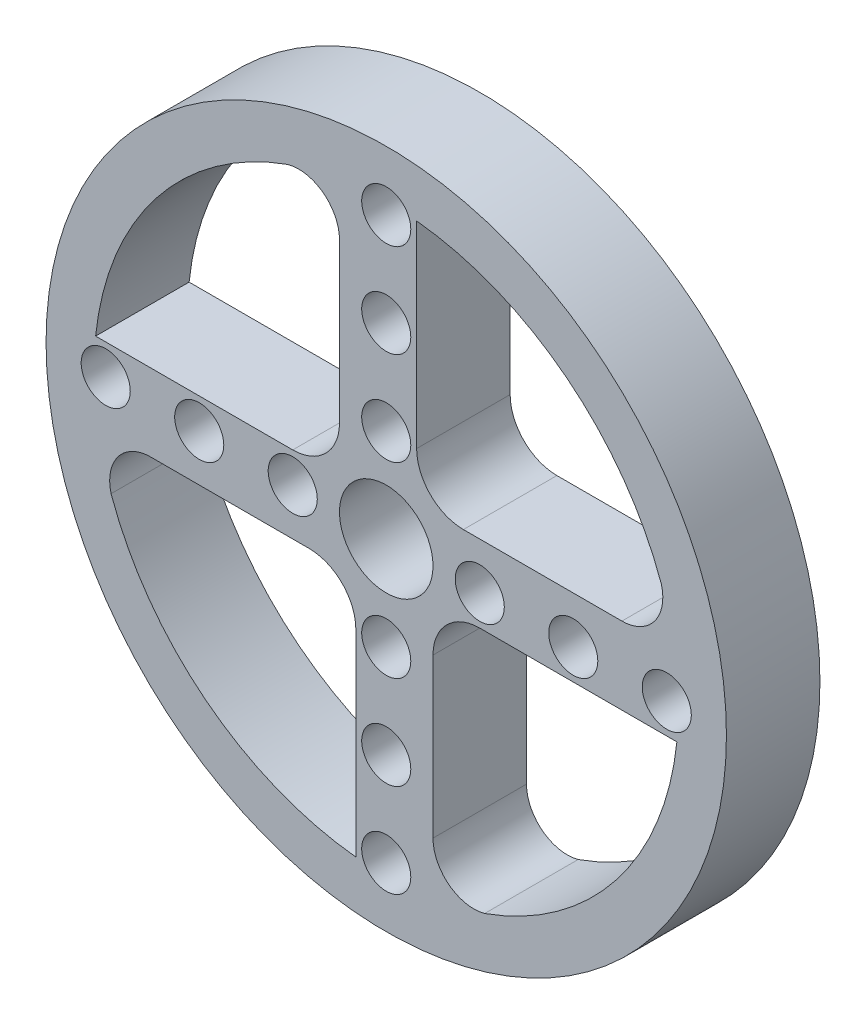
ISO-10303-21;
HEADER;
FILE_DESCRIPTION(('STEP AP214'),'2;1');
FILE_NAME('part.step','',(''),(''),'','','');
FILE_SCHEMA(('AUTOMOTIVE_DESIGN { 1 0 10303 214 1 1 1 1 }'));
ENDSEC;
DATA;
#1=APPLICATION_CONTEXT('core data for automotive mechanical design processes');
#2=APPLICATION_PROTOCOL_DEFINITION('international standard','automotive_design',2000,#1);
#3=PRODUCT_CONTEXT('',#1,'mechanical');
#4=PRODUCT('Part','Part','',(#3));
#5=PRODUCT_RELATED_PRODUCT_CATEGORY('part','',(#4));
#6=PRODUCT_DEFINITION_FORMATION('','',#4);
#7=PRODUCT_DEFINITION_CONTEXT('part definition',#1,'design');
#8=PRODUCT_DEFINITION('design','',#6,#7);
#9=PRODUCT_DEFINITION_SHAPE('','',#8);
#10=(LENGTH_UNIT() NAMED_UNIT(*) SI_UNIT(.MILLI.,.METRE.));
#11=(NAMED_UNIT(*) PLANE_ANGLE_UNIT() SI_UNIT($,.RADIAN.));
#12=(NAMED_UNIT(*) SI_UNIT($,.STERADIAN.) SOLID_ANGLE_UNIT());
#13=UNCERTAINTY_MEASURE_WITH_UNIT(LENGTH_MEASURE(1.E-05),#10,'distance_accuracy_value','');
#14=(GEOMETRIC_REPRESENTATION_CONTEXT(3) GLOBAL_UNCERTAINTY_ASSIGNED_CONTEXT((#13)) GLOBAL_UNIT_ASSIGNED_CONTEXT((#10,
#11,#12)) REPRESENTATION_CONTEXT('',''));
#15=CARTESIAN_POINT('',(0.,0.,0.));
#16=DIRECTION('',(0.,0.,1.));
#17=DIRECTION('',(1.,0.,0.));
#18=AXIS2_PLACEMENT_3D('',#15,#16,#17);
#19=CARTESIAN_POINT('',(0.,4.,8.));
#20=DIRECTION('',(0.,1.,0.));
#21=DIRECTION('',(-1.,0.,0.));
#22=AXIS2_PLACEMENT_3D('',#19,#20,#21);
#23=PLANE('',#22);
#24=DIRECTION('',(1.,0.,0.));
#25=VECTOR('',#24,1.);
#26=CARTESIAN_POINT('',(0.,4.,0.));
#27=LINE('',#26,#25);
#28=CARTESIAN_POINT('',(6.59999999999997,3.99999999999996,0.));
#29=VERTEX_POINT('',#28);
#30=CARTESIAN_POINT('',(20.1628902848437,3.99999999999986,0.));
#31=VERTEX_POINT('',#30);
#32=EDGE_CURVE('E332',#29,#31,#27,.T.);
#33=ORIENTED_EDGE('',*,*,#32,.F.);
#34=DIRECTION('',(0.,0.,-1.));
#35=VECTOR('',#34,1.);
#36=CARTESIAN_POINT('',(6.59999999999997,3.99999999999996,8.));
#37=LINE('',#36,#35);
#38=CARTESIAN_POINT('',(6.59999999999997,3.99999999999996,8.));
#39=VERTEX_POINT('',#38);
#40=EDGE_CURVE('E11',#39,#29,#37,.T.);
#41=ORIENTED_EDGE('',*,*,#40,.F.);
#42=DIRECTION('',(1.,0.,0.));
#43=VECTOR('',#42,1.);
#44=CARTESIAN_POINT('',(0.,4.,8.));
#45=LINE('',#44,#43);
#46=CARTESIAN_POINT('',(20.1628902848437,3.99999999999986,8.));
#47=VERTEX_POINT('',#46);
#48=EDGE_CURVE('E245',#39,#47,#45,.T.);
#49=ORIENTED_EDGE('',*,*,#48,.T.);
#50=DIRECTION('',(0.,0.,-1.));
#51=VECTOR('',#50,1.);
#52=CARTESIAN_POINT('',(20.1628902848437,3.99999999999986,8.));
#53=LINE('',#52,#51);
#54=EDGE_CURVE('E51',#47,#31,#53,.T.);
#55=ORIENTED_EDGE('',*,*,#54,.T.);
#56=EDGE_LOOP('',(#33,#41,#49,#55));
#57=FACE_BOUND('',#56,.T.);
#58=ADVANCED_FACE('F32',(#57),#23,.T.);
#59=CARTESIAN_POINT('',(6.6,8.00000000000002,8.));
#60=DIRECTION('',(0.,0.,-1.));
#61=DIRECTION('',(-1.,0.,0.));
#62=AXIS2_PLACEMENT_3D('',#59,#60,#61);
#63=CYLINDRICAL_SURFACE('',#62,4.);
#64=CARTESIAN_POINT('',(6.6,8.00000000000002,0.));
#65=DIRECTION('',(0.,0.,1.));
#66=DIRECTION('',(1.,0.,0.));
#67=AXIS2_PLACEMENT_3D('',#64,#65,#66);
#68=CIRCLE('',#67,4.);
#69=CARTESIAN_POINT('',(2.6,8.00000000000002,0.));
#70=VERTEX_POINT('',#69);
#71=EDGE_CURVE('E334',#70,#29,#68,.T.);
#72=ORIENTED_EDGE('',*,*,#71,.F.);
#73=DIRECTION('',(0.,0.,-1.));
#74=VECTOR('',#73,1.);
#75=CARTESIAN_POINT('',(2.6,8.00000000000002,8.));
#76=LINE('',#75,#74);
#77=CARTESIAN_POINT('',(2.6,8.00000000000002,8.));
#78=VERTEX_POINT('',#77);
#79=EDGE_CURVE('E42',#78,#70,#76,.T.);
#80=ORIENTED_EDGE('',*,*,#79,.F.);
#81=CARTESIAN_POINT('',(6.6,8.00000000000002,8.));
#82=DIRECTION('',(0.,0.,1.));
#83=DIRECTION('',(1.,0.,0.));
#84=AXIS2_PLACEMENT_3D('',#81,#82,#83);
#85=CIRCLE('',#84,4.);
#86=EDGE_CURVE('E195',#78,#39,#85,.T.);
#87=ORIENTED_EDGE('',*,*,#86,.T.);
#88=ORIENTED_EDGE('',*,*,#40,.T.);
#89=EDGE_LOOP('',(#72,#80,#87,#88));
#90=FACE_BOUND('',#89,.T.);
#91=ADVANCED_FACE('F454',(#90),#63,.F.);
#92=CARTESIAN_POINT('',(2.6,0.,8.));
#93=DIRECTION('',(1.,0.,0.));
#94=DIRECTION('',(0.,1.,0.));
#95=AXIS2_PLACEMENT_3D('',#92,#93,#94);
#96=PLANE('',#95);
#97=DIRECTION('',(0.,-1.,0.));
#98=VECTOR('',#97,1.);
#99=CARTESIAN_POINT('',(2.6,0.,0.));
#100=LINE('',#99,#98);
#101=CARTESIAN_POINT('',(2.59999999999953,24.8644324286766,0.));
#102=VERTEX_POINT('',#101);
#103=EDGE_CURVE('E181',#102,#70,#100,.T.);
#104=ORIENTED_EDGE('',*,*,#103,.F.);
#105=DIRECTION('',(0.,0.,-1.));
#106=VECTOR('',#105,1.);
#107=CARTESIAN_POINT('',(2.59999999999953,24.8644324286766,8.));
#108=LINE('',#107,#106);
#109=CARTESIAN_POINT('',(2.59999999999953,24.8644324286766,8.));
#110=VERTEX_POINT('',#109);
#111=EDGE_CURVE('E176',#110,#102,#108,.T.);
#112=ORIENTED_EDGE('',*,*,#111,.F.);
#113=DIRECTION('',(0.,-1.,0.));
#114=VECTOR('',#113,1.);
#115=CARTESIAN_POINT('',(2.6,0.,8.));
#116=LINE('',#115,#114);
#117=EDGE_CURVE('E179',#110,#78,#116,.T.);
#118=ORIENTED_EDGE('',*,*,#117,.T.);
#119=ORIENTED_EDGE('',*,*,#79,.T.);
#120=EDGE_LOOP('',(#104,#112,#118,#119));
#121=FACE_BOUND('',#120,.T.);
#122=ADVANCED_FACE('F178',(#121),#96,.T.);
#123=CARTESIAN_POINT('',(0.,0.,8.));
#124=DIRECTION('',(0.,0.,-1.));
#125=DIRECTION('',(-1.,0.,0.));
#126=AXIS2_PLACEMENT_3D('',#123,#124,#125);
#127=CYLINDRICAL_SURFACE('',#126,25.);
#128=CARTESIAN_POINT('',(0.,0.,0.));
#129=DIRECTION('',(0.,0.,1.));
#130=DIRECTION('',(1.,0.,0.));
#131=AXIS2_PLACEMENT_3D('',#128,#129,#130);
#132=CIRCLE('',#131,25.);
#133=CARTESIAN_POINT('',(23.5410982720302,8.41526542342064,0.));
#134=VERTEX_POINT('',#133);
#135=EDGE_CURVE('E303',#134,#102,#132,.T.);
#136=ORIENTED_EDGE('',*,*,#135,.F.);
#137=DIRECTION('',(0.,0.,-1.));
#138=VECTOR('',#137,1.);
#139=CARTESIAN_POINT('',(23.5410982720302,8.41526542342064,8.));
#140=LINE('',#139,#138);
#141=CARTESIAN_POINT('',(23.5410982720302,8.41526542342064,8.));
#142=VERTEX_POINT('',#141);
#143=EDGE_CURVE('E112',#142,#134,#140,.T.);
#144=ORIENTED_EDGE('',*,*,#143,.F.);
#145=CARTESIAN_POINT('',(0.,0.,8.));
#146=DIRECTION('',(0.,0.,1.));
#147=DIRECTION('',(1.,0.,0.));
#148=AXIS2_PLACEMENT_3D('',#145,#146,#147);
#149=CIRCLE('',#148,25.);
#150=EDGE_CURVE('E193',#142,#110,#149,.T.);
#151=ORIENTED_EDGE('',*,*,#150,.T.);
#152=ORIENTED_EDGE('',*,*,#111,.T.);
#153=EDGE_LOOP('',(#136,#144,#151,#152));
#154=FACE_BOUND('',#153,.T.);
#155=ADVANCED_FACE('F197',(#154),#127,.F.);
#156=CARTESIAN_POINT('',(-4.,0.,8.));
#157=DIRECTION('',(-1.,0.,0.));
#158=DIRECTION('',(0.,-1.,0.));
#159=AXIS2_PLACEMENT_3D('',#156,#157,#158);
#160=PLANE('',#159);
#161=DIRECTION('',(0.,1.,0.));
#162=VECTOR('',#161,1.);
#163=CARTESIAN_POINT('',(-4.,0.,0.));
#164=LINE('',#163,#162);
#165=CARTESIAN_POINT('',(-3.99999999999998,6.59999999999999,0.));
#166=VERTEX_POINT('',#165);
#167=CARTESIAN_POINT('',(-3.99999999999993,20.1628902848436,0.));
#168=VERTEX_POINT('',#167);
#169=EDGE_CURVE('E319',#166,#168,#164,.T.);
#170=ORIENTED_EDGE('',*,*,#169,.F.);
#171=DIRECTION('',(0.,0.,-1.));
#172=VECTOR('',#171,1.);
#173=CARTESIAN_POINT('',(-3.99999999999998,6.59999999999999,8.));
#174=LINE('',#173,#172);
#175=CARTESIAN_POINT('',(-3.99999999999998,6.59999999999999,8.));
#176=VERTEX_POINT('',#175);
#177=EDGE_CURVE('E385',#176,#166,#174,.T.);
#178=ORIENTED_EDGE('',*,*,#177,.F.);
#179=DIRECTION('',(0.,1.,0.));
#180=VECTOR('',#179,1.);
#181=CARTESIAN_POINT('',(-4.,0.,8.));
#182=LINE('',#181,#180);
#183=CARTESIAN_POINT('',(-3.99999999999993,20.1628902848436,8.));
#184=VERTEX_POINT('',#183);
#185=EDGE_CURVE('E225',#176,#184,#182,.T.);
#186=ORIENTED_EDGE('',*,*,#185,.T.);
#187=DIRECTION('',(0.,0.,-1.));
#188=VECTOR('',#187,1.);
#189=CARTESIAN_POINT('',(-3.99999999999993,20.1628902848436,8.));
#190=LINE('',#189,#188);
#191=EDGE_CURVE('E388',#184,#168,#190,.T.);
#192=ORIENTED_EDGE('',*,*,#191,.T.);
#193=EDGE_LOOP('',(#170,#178,#186,#192));
#194=FACE_BOUND('',#193,.T.);
#195=ADVANCED_FACE('F452',(#194),#160,.T.);
#196=CARTESIAN_POINT('',(-8.,6.6,8.));
#197=DIRECTION('',(0.,0.,-1.));
#198=DIRECTION('',(-1.,0.,0.));
#199=AXIS2_PLACEMENT_3D('',#196,#197,#198);
#200=CYLINDRICAL_SURFACE('',#199,4.);
#201=CARTESIAN_POINT('',(-8.,6.6,0.));
#202=DIRECTION('',(0.,0.,1.));
#203=DIRECTION('',(1.,0.,0.));
#204=AXIS2_PLACEMENT_3D('',#201,#202,#203);
#205=CIRCLE('',#204,4.);
#206=CARTESIAN_POINT('',(-8.,2.6,0.));
#207=VERTEX_POINT('',#206);
#208=EDGE_CURVE('E322',#207,#166,#205,.T.);
#209=ORIENTED_EDGE('',*,*,#208,.F.);
#210=DIRECTION('',(0.,0.,-1.));
#211=VECTOR('',#210,1.);
#212=CARTESIAN_POINT('',(-8.,2.6,8.));
#213=LINE('',#212,#211);
#214=CARTESIAN_POINT('',(-8.,2.6,8.));
#215=VERTEX_POINT('',#214);
#216=EDGE_CURVE('E395',#215,#207,#213,.T.);
#217=ORIENTED_EDGE('',*,*,#216,.F.);
#218=CARTESIAN_POINT('',(-8.,6.6,8.));
#219=DIRECTION('',(0.,0.,1.));
#220=DIRECTION('',(1.,0.,0.));
#221=AXIS2_PLACEMENT_3D('',#218,#219,#220);
#222=CIRCLE('',#221,4.);
#223=EDGE_CURVE('E238',#215,#176,#222,.T.);
#224=ORIENTED_EDGE('',*,*,#223,.T.);
#225=ORIENTED_EDGE('',*,*,#177,.T.);
#226=EDGE_LOOP('',(#209,#217,#224,#225));
#227=FACE_BOUND('',#226,.T.);
#228=ADVANCED_FACE('F471',(#227),#200,.F.);
#229=CARTESIAN_POINT('',(0.,2.6,8.));
#230=DIRECTION('',(0.,1.,0.));
#231=DIRECTION('',(0.,0.,1.));
#232=AXIS2_PLACEMENT_3D('',#229,#230,#231);
#233=PLANE('',#232);
#234=DIRECTION('',(1.,0.,0.));
#235=VECTOR('',#234,1.);
#236=CARTESIAN_POINT('',(0.,2.6,0.));
#237=LINE('',#236,#235);
#238=CARTESIAN_POINT('',(-24.8644324286766,2.59999999999954,0.));
#239=VERTEX_POINT('',#238);
#240=EDGE_CURVE('E325',#239,#207,#237,.T.);
#241=ORIENTED_EDGE('',*,*,#240,.F.);
#242=DIRECTION('',(0.,0.,-1.));
#243=VECTOR('',#242,1.);
#244=CARTESIAN_POINT('',(-24.8644324286766,2.59999999999954,8.));
#245=LINE('',#244,#243);
#246=CARTESIAN_POINT('',(-24.8644324286766,2.59999999999954,8.));
#247=VERTEX_POINT('',#246);
#248=EDGE_CURVE('E393',#247,#239,#245,.T.);
#249=ORIENTED_EDGE('',*,*,#248,.F.);
#250=DIRECTION('',(1.,0.,0.));
#251=VECTOR('',#250,1.);
#252=CARTESIAN_POINT('',(0.,2.6,8.));
#253=LINE('',#252,#251);
#254=EDGE_CURVE('E208',#247,#215,#253,.T.);
#255=ORIENTED_EDGE('',*,*,#254,.T.);
#256=ORIENTED_EDGE('',*,*,#216,.T.);
#257=EDGE_LOOP('',(#241,#249,#255,#256));
#258=FACE_BOUND('',#257,.T.);
#259=ADVANCED_FACE('F468',(#258),#233,.T.);
#260=CARTESIAN_POINT('',(-8.41526542342072,23.5410982720301,0.));
#261=VERTEX_POINT('',#260);
#262=EDGE_CURVE('E328',#261,#239,#132,.T.);
#263=ORIENTED_EDGE('',*,*,#262,.F.);
#264=DIRECTION('',(0.,0.,-1.));
#265=VECTOR('',#264,1.);
#266=CARTESIAN_POINT('',(-8.41526542342072,23.5410982720301,8.));
#267=LINE('',#266,#265);
#268=CARTESIAN_POINT('',(-8.41526542342072,23.5410982720301,8.));
#269=VERTEX_POINT('',#268);
#270=EDGE_CURVE('E390',#269,#261,#267,.T.);
#271=ORIENTED_EDGE('',*,*,#270,.F.);
#272=EDGE_CURVE('E200',#269,#247,#149,.T.);
#273=ORIENTED_EDGE('',*,*,#272,.T.);
#274=ORIENTED_EDGE('',*,*,#248,.T.);
#275=EDGE_LOOP('',(#263,#271,#273,#274));
#276=FACE_BOUND('',#275,.T.);
#277=ADVANCED_FACE('F450',(#276),#127,.F.);
#278=CARTESIAN_POINT('',(0.,-4.,8.));
#279=DIRECTION('',(0.,-1.,0.));
#280=DIRECTION('',(1.,0.,0.));
#281=AXIS2_PLACEMENT_3D('',#278,#279,#280);
#282=PLANE('',#281);
#283=DIRECTION('',(-1.,0.,0.));
#284=VECTOR('',#283,1.);
#285=CARTESIAN_POINT('',(0.,-4.,0.));
#286=LINE('',#285,#284);
#287=CARTESIAN_POINT('',(-6.59999999999998,-4.,0.));
#288=VERTEX_POINT('',#287);
#289=CARTESIAN_POINT('',(-20.1628902848436,-4.,0.));
#290=VERTEX_POINT('',#289);
#291=EDGE_CURVE('E307',#288,#290,#286,.T.);
#292=ORIENTED_EDGE('',*,*,#291,.F.);
#293=DIRECTION('',(0.,0.,-1.));
#294=VECTOR('',#293,1.);
#295=CARTESIAN_POINT('',(-6.59999999999998,-4.,8.));
#296=LINE('',#295,#294);
#297=CARTESIAN_POINT('',(-6.59999999999998,-4.,8.));
#298=VERTEX_POINT('',#297);
#299=EDGE_CURVE('E391',#298,#288,#296,.T.);
#300=ORIENTED_EDGE('',*,*,#299,.F.);
#301=DIRECTION('',(-1.,0.,0.));
#302=VECTOR('',#301,1.);
#303=CARTESIAN_POINT('',(0.,-4.,8.));
#304=LINE('',#303,#302);
#305=CARTESIAN_POINT('',(-20.1628902848436,-4.,8.));
#306=VERTEX_POINT('',#305);
#307=EDGE_CURVE('E216',#298,#306,#304,.T.);
#308=ORIENTED_EDGE('',*,*,#307,.T.);
#309=DIRECTION('',(0.,0.,-1.));
#310=VECTOR('',#309,1.);
#311=CARTESIAN_POINT('',(-20.1628902848436,-4.,8.));
#312=LINE('',#311,#310);
#313=EDGE_CURVE('E398',#306,#290,#312,.T.);
#314=ORIENTED_EDGE('',*,*,#313,.T.);
#315=EDGE_LOOP('',(#292,#300,#308,#314));
#316=FACE_BOUND('',#315,.T.);
#317=ADVANCED_FACE('F487',(#316),#282,.T.);
#318=CARTESIAN_POINT('',(-6.59999999999998,-8.,8.));
#319=DIRECTION('',(0.,0.,-1.));
#320=DIRECTION('',(-1.,0.,0.));
#321=AXIS2_PLACEMENT_3D('',#318,#319,#320);
#322=CYLINDRICAL_SURFACE('',#321,4.);
#323=CARTESIAN_POINT('',(-6.59999999999998,-8.,0.));
#324=DIRECTION('',(0.,0.,1.));
#325=DIRECTION('',(1.,0.,0.));
#326=AXIS2_PLACEMENT_3D('',#323,#324,#325);
#327=CIRCLE('',#326,4.);
#328=CARTESIAN_POINT('',(-2.59999999999998,-8.,0.));
#329=VERTEX_POINT('',#328);
#330=EDGE_CURVE('E310',#329,#288,#327,.T.);
#331=ORIENTED_EDGE('',*,*,#330,.F.);
#332=DIRECTION('',(0.,0.,-1.));
#333=VECTOR('',#332,1.);
#334=CARTESIAN_POINT('',(-2.59999999999998,-8.,8.));
#335=LINE('',#334,#333);
#336=CARTESIAN_POINT('',(-2.59999999999998,-8.,8.));
#337=VERTEX_POINT('',#336);
#338=EDGE_CURVE('E404',#337,#329,#335,.T.);
#339=ORIENTED_EDGE('',*,*,#338,.F.);
#340=CARTESIAN_POINT('',(-6.59999999999998,-8.,8.));
#341=DIRECTION('',(0.,0.,1.));
#342=DIRECTION('',(1.,0.,0.));
#343=AXIS2_PLACEMENT_3D('',#340,#341,#342);
#344=CIRCLE('',#343,4.);
#345=EDGE_CURVE('E228',#337,#298,#344,.T.);
#346=ORIENTED_EDGE('',*,*,#345,.T.);
#347=ORIENTED_EDGE('',*,*,#299,.T.);
#348=EDGE_LOOP('',(#331,#339,#346,#347));
#349=FACE_BOUND('',#348,.T.);
#350=ADVANCED_FACE('F484',(#349),#322,.F.);
#351=CARTESIAN_POINT('',(-2.59999999999998,0.,8.));
#352=DIRECTION('',(-1.,0.,0.));
#353=DIRECTION('',(0.,-1.,0.));
#354=AXIS2_PLACEMENT_3D('',#351,#352,#353);
#355=PLANE('',#354);
#356=DIRECTION('',(0.,1.,0.));
#357=VECTOR('',#356,1.);
#358=CARTESIAN_POINT('',(-2.59999999999998,0.,0.));
#359=LINE('',#358,#357);
#360=CARTESIAN_POINT('',(-2.59999999999951,-24.8644324286766,0.));
#361=VERTEX_POINT('',#360);
#362=EDGE_CURVE('E313',#361,#329,#359,.T.);
#363=ORIENTED_EDGE('',*,*,#362,.F.);
#364=DIRECTION('',(0.,0.,-1.));
#365=VECTOR('',#364,1.);
#366=CARTESIAN_POINT('',(-2.59999999999951,-24.8644324286766,8.));
#367=LINE('',#366,#365);
#368=CARTESIAN_POINT('',(-2.59999999999951,-24.8644324286766,8.));
#369=VERTEX_POINT('',#368);
#370=EDGE_CURVE('E402',#369,#361,#367,.T.);
#371=ORIENTED_EDGE('',*,*,#370,.F.);
#372=DIRECTION('',(0.,1.,0.));
#373=VECTOR('',#372,1.);
#374=CARTESIAN_POINT('',(-2.59999999999998,0.,8.));
#375=LINE('',#374,#373);
#376=EDGE_CURVE('E221',#369,#337,#375,.T.);
#377=ORIENTED_EDGE('',*,*,#376,.T.);
#378=ORIENTED_EDGE('',*,*,#338,.T.);
#379=EDGE_LOOP('',(#363,#371,#377,#378));
#380=FACE_BOUND('',#379,.T.);
#381=ADVANCED_FACE('F449',(#380),#355,.T.);
#382=CARTESIAN_POINT('',(-23.5410982720301,-8.4152654234208,0.));
#383=VERTEX_POINT('',#382);
#384=EDGE_CURVE('E304',#383,#361,#132,.T.);
#385=ORIENTED_EDGE('',*,*,#384,.F.);
#386=DIRECTION('',(0.,0.,-1.));
#387=VECTOR('',#386,1.);
#388=CARTESIAN_POINT('',(-23.5410982720301,-8.4152654234208,8.));
#389=LINE('',#388,#387);
#390=CARTESIAN_POINT('',(-23.5410982720301,-8.4152654234208,8.));
#391=VERTEX_POINT('',#390);
#392=EDGE_CURVE('E400',#391,#383,#389,.T.);
#393=ORIENTED_EDGE('',*,*,#392,.F.);
#394=EDGE_CURVE('E209',#391,#369,#149,.T.);
#395=ORIENTED_EDGE('',*,*,#394,.T.);
#396=ORIENTED_EDGE('',*,*,#370,.T.);
#397=EDGE_LOOP('',(#385,#393,#395,#396));
#398=FACE_BOUND('',#397,.T.);
#399=ADVANCED_FACE('F437',(#398),#127,.F.);
#400=CARTESIAN_POINT('',(4.,0.,8.));
#401=DIRECTION('',(1.,0.,0.));
#402=DIRECTION('',(0.,1.,0.));
#403=AXIS2_PLACEMENT_3D('',#400,#401,#402);
#404=PLANE('',#403);
#405=DIRECTION('',(0.,-1.,0.));
#406=VECTOR('',#405,1.);
#407=CARTESIAN_POINT('',(4.,0.,0.));
#408=LINE('',#407,#406);
#409=CARTESIAN_POINT('',(3.99999999999993,-6.59999999999993,0.));
#410=VERTEX_POINT('',#409);
#411=CARTESIAN_POINT('',(3.99999999999979,-20.1628902848437,0.));
#412=VERTEX_POINT('',#411);
#413=EDGE_CURVE('E290',#410,#412,#408,.T.);
#414=ORIENTED_EDGE('',*,*,#413,.F.);
#415=DIRECTION('',(0.,0.,-1.));
#416=VECTOR('',#415,1.);
#417=CARTESIAN_POINT('',(3.99999999999993,-6.59999999999993,8.));
#418=LINE('',#417,#416);
#419=CARTESIAN_POINT('',(3.99999999999993,-6.59999999999993,8.));
#420=VERTEX_POINT('',#419);
#421=EDGE_CURVE('E36',#420,#410,#418,.T.);
#422=ORIENTED_EDGE('',*,*,#421,.F.);
#423=DIRECTION('',(0.,-1.,0.));
#424=VECTOR('',#423,1.);
#425=CARTESIAN_POINT('',(4.,0.,8.));
#426=LINE('',#425,#424);
#427=CARTESIAN_POINT('',(3.99999999999979,-20.1628902848437,8.));
#428=VERTEX_POINT('',#427);
#429=EDGE_CURVE('E383',#420,#428,#426,.T.);
#430=ORIENTED_EDGE('',*,*,#429,.T.);
#431=DIRECTION('',(0.,0.,-1.));
#432=VECTOR('',#431,1.);
#433=CARTESIAN_POINT('',(3.99999999999979,-20.1628902848437,8.));
#434=LINE('',#433,#432);
#435=EDGE_CURVE('E289',#428,#412,#434,.T.);
#436=ORIENTED_EDGE('',*,*,#435,.T.);
#437=EDGE_LOOP('',(#414,#422,#430,#436));
#438=FACE_BOUND('',#437,.T.);
#439=ADVANCED_FACE('F34',(#438),#404,.T.);
#440=CARTESIAN_POINT('',(8.00000000000002,-6.59999999999997,8.));
#441=DIRECTION('',(0.,0.,-1.));
#442=DIRECTION('',(-1.,0.,0.));
#443=AXIS2_PLACEMENT_3D('',#440,#441,#442);
#444=CYLINDRICAL_SURFACE('',#443,4.);
#445=CARTESIAN_POINT('',(8.00000000000002,-6.59999999999997,0.));
#446=DIRECTION('',(0.,0.,1.));
#447=DIRECTION('',(1.,0.,0.));
#448=AXIS2_PLACEMENT_3D('',#445,#446,#447);
#449=CIRCLE('',#448,4.);
#450=CARTESIAN_POINT('',(8.00000000000002,-2.59999999999997,0.));
#451=VERTEX_POINT('',#450);
#452=EDGE_CURVE('E293',#451,#410,#449,.T.);
#453=ORIENTED_EDGE('',*,*,#452,.F.);
#454=DIRECTION('',(0.,0.,-1.));
#455=VECTOR('',#454,1.);
#456=CARTESIAN_POINT('',(8.00000000000002,-2.59999999999997,8.));
#457=LINE('',#456,#455);
#458=CARTESIAN_POINT('',(8.00000000000002,-2.59999999999997,8.));
#459=VERTEX_POINT('',#458);
#460=EDGE_CURVE('E411',#459,#451,#457,.T.);
#461=ORIENTED_EDGE('',*,*,#460,.F.);
#462=CARTESIAN_POINT('',(8.00000000000002,-6.59999999999997,8.));
#463=DIRECTION('',(0.,0.,1.));
#464=DIRECTION('',(1.,0.,0.));
#465=AXIS2_PLACEMENT_3D('',#462,#463,#464);
#466=CIRCLE('',#465,4.);
#467=EDGE_CURVE('E218',#459,#420,#466,.T.);
#468=ORIENTED_EDGE('',*,*,#467,.T.);
#469=ORIENTED_EDGE('',*,*,#421,.T.);
#470=EDGE_LOOP('',(#453,#461,#468,#469));
#471=FACE_BOUND('',#470,.T.);
#472=ADVANCED_FACE('F417',(#471),#444,.F.);
#473=CARTESIAN_POINT('',(0.,-2.59999999999998,8.));
#474=DIRECTION('',(0.,-1.,0.));
#475=DIRECTION('',(1.,0.,0.));
#476=AXIS2_PLACEMENT_3D('',#473,#474,#475);
#477=PLANE('',#476);
#478=DIRECTION('',(-1.,0.,0.));
#479=VECTOR('',#478,1.);
#480=CARTESIAN_POINT('',(0.,-2.59999999999998,0.));
#481=LINE('',#480,#479);
#482=CARTESIAN_POINT('',(24.8644324286766,-2.59999999999951,0.));
#483=VERTEX_POINT('',#482);
#484=EDGE_CURVE('E296',#483,#451,#481,.T.);
#485=ORIENTED_EDGE('',*,*,#484,.F.);
#486=DIRECTION('',(0.,0.,-1.));
#487=VECTOR('',#486,1.);
#488=CARTESIAN_POINT('',(24.8644324286766,-2.59999999999951,8.));
#489=LINE('',#488,#487);
#490=CARTESIAN_POINT('',(24.8644324286766,-2.59999999999951,8.));
#491=VERTEX_POINT('',#490);
#492=EDGE_CURVE('E410',#491,#483,#489,.T.);
#493=ORIENTED_EDGE('',*,*,#492,.F.);
#494=DIRECTION('',(-1.,0.,0.));
#495=VECTOR('',#494,1.);
#496=CARTESIAN_POINT('',(0.,-2.59999999999998,8.));
#497=LINE('',#496,#495);
#498=EDGE_CURVE('E212',#491,#459,#497,.T.);
#499=ORIENTED_EDGE('',*,*,#498,.T.);
#500=ORIENTED_EDGE('',*,*,#460,.T.);
#501=EDGE_LOOP('',(#485,#493,#499,#500));
#502=FACE_BOUND('',#501,.T.);
#503=ADVANCED_FACE('F424',(#502),#477,.T.);
#504=CARTESIAN_POINT('',(8.41526542342056,-23.5410982720302,0.));
#505=VERTEX_POINT('',#504);
#506=EDGE_CURVE('E299',#505,#483,#132,.T.);
#507=ORIENTED_EDGE('',*,*,#506,.F.);
#508=DIRECTION('',(0.,0.,-1.));
#509=VECTOR('',#508,1.);
#510=CARTESIAN_POINT('',(8.41526542342056,-23.5410982720302,8.));
#511=LINE('',#510,#509);
#512=CARTESIAN_POINT('',(8.41526542342056,-23.5410982720302,8.));
#513=VERTEX_POINT('',#512);
#514=EDGE_CURVE('E408',#513,#505,#511,.T.);
#515=ORIENTED_EDGE('',*,*,#514,.F.);
#516=EDGE_CURVE('E201',#513,#491,#149,.T.);
#517=ORIENTED_EDGE('',*,*,#516,.T.);
#518=ORIENTED_EDGE('',*,*,#492,.T.);
#519=EDGE_LOOP('',(#507,#515,#517,#518));
#520=FACE_BOUND('',#519,.T.);
#521=ADVANCED_FACE('F433',(#520),#127,.F.);
#522=CARTESIAN_POINT('',(8.,0.,8.));
#523=DIRECTION('',(0.,0.,-1.));
#524=DIRECTION('',(-1.,0.,0.));
#525=AXIS2_PLACEMENT_3D('',#522,#523,#524);
#526=CYLINDRICAL_SURFACE('',#525,2.1);
#527=CARTESIAN_POINT('',(8.,0.,8.));
#528=DIRECTION('',(0.,0.,1.));
#529=DIRECTION('',(1.,0.,0.));
#530=AXIS2_PLACEMENT_3D('',#527,#528,#529);
#531=CIRCLE('',#530,2.1);
#532=CARTESIAN_POINT('',(10.1,0.,8.));
#533=VERTEX_POINT('',#532);
#534=EDGE_CURVE('E283',#533,#533,#531,.T.);
#535=ORIENTED_EDGE('',*,*,#534,.T.);
#536=EDGE_LOOP('',(#535));
#537=FACE_BOUND('',#536,.T.);
#538=CARTESIAN_POINT('',(8.,0.,0.));
#539=DIRECTION('',(0.,0.,1.));
#540=DIRECTION('',(1.,0.,0.));
#541=AXIS2_PLACEMENT_3D('',#538,#539,#540);
#542=CIRCLE('',#541,2.1);
#543=CARTESIAN_POINT('',(10.1,0.,0.));
#544=VERTEX_POINT('',#543);
#545=EDGE_CURVE('E377',#544,#544,#542,.T.);
#546=ORIENTED_EDGE('',*,*,#545,.F.);
#547=EDGE_LOOP('',(#546));
#548=FACE_BOUND('',#547,.T.);
#549=ADVANCED_FACE('F435',(#537,#548),#526,.F.);
#550=CARTESIAN_POINT('',(0.,-8.,8.));
#551=DIRECTION('',(0.,0.,-1.));
#552=DIRECTION('',(-1.,0.,0.));
#553=AXIS2_PLACEMENT_3D('',#550,#551,#552);
#554=CYLINDRICAL_SURFACE('',#553,2.1);
#555=CARTESIAN_POINT('',(0.,-8.,8.));
#556=DIRECTION('',(0.,0.,1.));
#557=DIRECTION('',(1.,0.,0.));
#558=AXIS2_PLACEMENT_3D('',#555,#556,#557);
#559=CIRCLE('',#558,2.1);
#560=CARTESIAN_POINT('',(2.1,-8.,8.));
#561=VERTEX_POINT('',#560);
#562=EDGE_CURVE('E280',#561,#561,#559,.T.);
#563=ORIENTED_EDGE('',*,*,#562,.T.);
#564=EDGE_LOOP('',(#563));
#565=FACE_BOUND('',#564,.T.);
#566=CARTESIAN_POINT('',(0.,-8.,0.));
#567=DIRECTION('',(0.,0.,1.));
#568=DIRECTION('',(1.,0.,0.));
#569=AXIS2_PLACEMENT_3D('',#566,#567,#568);
#570=CIRCLE('',#569,2.1);
#571=CARTESIAN_POINT('',(2.1,-8.,0.));
#572=VERTEX_POINT('',#571);
#573=EDGE_CURVE('E374',#572,#572,#570,.T.);
#574=ORIENTED_EDGE('',*,*,#573,.F.);
#575=EDGE_LOOP('',(#574));
#576=FACE_BOUND('',#575,.T.);
#577=ADVANCED_FACE('F442',(#565,#576),#554,.F.);
#578=CARTESIAN_POINT('',(0.,-16.,8.));
#579=DIRECTION('',(0.,0.,-1.));
#580=DIRECTION('',(-1.,0.,0.));
#581=AXIS2_PLACEMENT_3D('',#578,#579,#580);
#582=CYLINDRICAL_SURFACE('',#581,2.1);
#583=CARTESIAN_POINT('',(0.,-16.,8.));
#584=DIRECTION('',(0.,0.,1.));
#585=DIRECTION('',(1.,0.,0.));
#586=AXIS2_PLACEMENT_3D('',#583,#584,#585);
#587=CIRCLE('',#586,2.1);
#588=CARTESIAN_POINT('',(2.1,-16.,8.));
#589=VERTEX_POINT('',#588);
#590=EDGE_CURVE('E277',#589,#589,#587,.T.);
#591=ORIENTED_EDGE('',*,*,#590,.T.);
#592=EDGE_LOOP('',(#591));
#593=FACE_BOUND('',#592,.T.);
#594=CARTESIAN_POINT('',(0.,-16.,0.));
#595=DIRECTION('',(0.,0.,1.));
#596=DIRECTION('',(1.,0.,0.));
#597=AXIS2_PLACEMENT_3D('',#594,#595,#596);
#598=CIRCLE('',#597,2.1);
#599=CARTESIAN_POINT('',(2.1,-16.,0.));
#600=VERTEX_POINT('',#599);
#601=EDGE_CURVE('E371',#600,#600,#598,.T.);
#602=ORIENTED_EDGE('',*,*,#601,.F.);
#603=EDGE_LOOP('',(#602));
#604=FACE_BOUND('',#603,.T.);
#605=ADVANCED_FACE('F601',(#593,#604),#582,.F.);
#606=CARTESIAN_POINT('',(0.,16.,8.));
#607=DIRECTION('',(0.,0.,-1.));
#608=DIRECTION('',(-1.,0.,0.));
#609=AXIS2_PLACEMENT_3D('',#606,#607,#608);
#610=CYLINDRICAL_SURFACE('',#609,2.1);
#611=CARTESIAN_POINT('',(0.,16.,8.));
#612=DIRECTION('',(0.,0.,1.));
#613=DIRECTION('',(1.,0.,0.));
#614=AXIS2_PLACEMENT_3D('',#611,#612,#613);
#615=CIRCLE('',#614,2.1);
#616=CARTESIAN_POINT('',(2.1,16.,8.));
#617=VERTEX_POINT('',#616);
#618=EDGE_CURVE('E274',#617,#617,#615,.T.);
#619=ORIENTED_EDGE('',*,*,#618,.T.);
#620=EDGE_LOOP('',(#619));
#621=FACE_BOUND('',#620,.T.);
#622=CARTESIAN_POINT('',(0.,16.,0.));
#623=DIRECTION('',(0.,0.,1.));
#624=DIRECTION('',(1.,0.,0.));
#625=AXIS2_PLACEMENT_3D('',#622,#623,#624);
#626=CIRCLE('',#625,2.1);
#627=CARTESIAN_POINT('',(2.1,16.,0.));
#628=VERTEX_POINT('',#627);
#629=EDGE_CURVE('E368',#628,#628,#626,.T.);
#630=ORIENTED_EDGE('',*,*,#629,.F.);
#631=EDGE_LOOP('',(#630));
#632=FACE_BOUND('',#631,.T.);
#633=ADVANCED_FACE('F610',(#621,#632),#610,.F.);
#634=CARTESIAN_POINT('',(0.,8.,8.));
#635=DIRECTION('',(0.,0.,-1.));
#636=DIRECTION('',(-1.,0.,0.));
#637=AXIS2_PLACEMENT_3D('',#634,#635,#636);
#638=CYLINDRICAL_SURFACE('',#637,2.1);
#639=CARTESIAN_POINT('',(0.,8.,8.));
#640=DIRECTION('',(0.,0.,1.));
#641=DIRECTION('',(1.,0.,0.));
#642=AXIS2_PLACEMENT_3D('',#639,#640,#641);
#643=CIRCLE('',#642,2.1);
#644=CARTESIAN_POINT('',(2.1,8.,8.));
#645=VERTEX_POINT('',#644);
#646=EDGE_CURVE('E271',#645,#645,#643,.T.);
#647=ORIENTED_EDGE('',*,*,#646,.T.);
#648=EDGE_LOOP('',(#647));
#649=FACE_BOUND('',#648,.T.);
#650=CARTESIAN_POINT('',(0.,8.,0.));
#651=DIRECTION('',(0.,0.,1.));
#652=DIRECTION('',(1.,0.,0.));
#653=AXIS2_PLACEMENT_3D('',#650,#651,#652);
#654=CIRCLE('',#653,2.1);
#655=CARTESIAN_POINT('',(2.1,8.,0.));
#656=VERTEX_POINT('',#655);
#657=EDGE_CURVE('E365',#656,#656,#654,.T.);
#658=ORIENTED_EDGE('',*,*,#657,.F.);
#659=EDGE_LOOP('',(#658));
#660=FACE_BOUND('',#659,.T.);
#661=ADVANCED_FACE('F619',(#649,#660),#638,.F.);
#662=CARTESIAN_POINT('',(-16.,0.,8.));
#663=DIRECTION('',(0.,0.,-1.));
#664=DIRECTION('',(-1.,0.,0.));
#665=AXIS2_PLACEMENT_3D('',#662,#663,#664);
#666=CYLINDRICAL_SURFACE('',#665,2.1);
#667=CARTESIAN_POINT('',(-16.,0.,8.));
#668=DIRECTION('',(0.,0.,1.));
#669=DIRECTION('',(1.,0.,0.));
#670=AXIS2_PLACEMENT_3D('',#667,#668,#669);
#671=CIRCLE('',#670,2.1);
#672=CARTESIAN_POINT('',(-13.9,0.,8.));
#673=VERTEX_POINT('',#672);
#674=EDGE_CURVE('E268',#673,#673,#671,.T.);
#675=ORIENTED_EDGE('',*,*,#674,.T.);
#676=EDGE_LOOP('',(#675));
#677=FACE_BOUND('',#676,.T.);
#678=CARTESIAN_POINT('',(-16.,0.,0.));
#679=DIRECTION('',(0.,0.,1.));
#680=DIRECTION('',(1.,0.,0.));
#681=AXIS2_PLACEMENT_3D('',#678,#679,#680);
#682=CIRCLE('',#681,2.1);
#683=CARTESIAN_POINT('',(-13.9,0.,0.));
#684=VERTEX_POINT('',#683);
#685=EDGE_CURVE('E362',#684,#684,#682,.T.);
#686=ORIENTED_EDGE('',*,*,#685,.F.);
#687=EDGE_LOOP('',(#686));
#688=FACE_BOUND('',#687,.T.);
#689=ADVANCED_FACE('F628',(#677,#688),#666,.F.);
#690=CARTESIAN_POINT('',(-8.,0.,8.));
#691=DIRECTION('',(0.,0.,-1.));
#692=DIRECTION('',(-1.,0.,0.));
#693=AXIS2_PLACEMENT_3D('',#690,#691,#692);
#694=CYLINDRICAL_SURFACE('',#693,2.1);
#695=CARTESIAN_POINT('',(-8.,0.,8.));
#696=DIRECTION('',(0.,0.,1.));
#697=DIRECTION('',(1.,0.,0.));
#698=AXIS2_PLACEMENT_3D('',#695,#696,#697);
#699=CIRCLE('',#698,2.1);
#700=CARTESIAN_POINT('',(-5.9,0.,8.));
#701=VERTEX_POINT('',#700);
#702=EDGE_CURVE('E265',#701,#701,#699,.T.);
#703=ORIENTED_EDGE('',*,*,#702,.T.);
#704=EDGE_LOOP('',(#703));
#705=FACE_BOUND('',#704,.T.);
#706=CARTESIAN_POINT('',(-8.,0.,0.));
#707=DIRECTION('',(0.,0.,1.));
#708=DIRECTION('',(1.,0.,0.));
#709=AXIS2_PLACEMENT_3D('',#706,#707,#708);
#710=CIRCLE('',#709,2.1);
#711=CARTESIAN_POINT('',(-5.9,0.,0.));
#712=VERTEX_POINT('',#711);
#713=EDGE_CURVE('E359',#712,#712,#710,.T.);
#714=ORIENTED_EDGE('',*,*,#713,.F.);
#715=EDGE_LOOP('',(#714));
#716=FACE_BOUND('',#715,.T.);
#717=ADVANCED_FACE('F637',(#705,#716),#694,.F.);
#718=CARTESIAN_POINT('',(0.,0.,8.));
#719=DIRECTION('',(0.,0.,-1.));
#720=DIRECTION('',(-1.,0.,0.));
#721=AXIS2_PLACEMENT_3D('',#718,#719,#720);
#722=CYLINDRICAL_SURFACE('',#721,29.105);
#723=CARTESIAN_POINT('',(0.,0.,8.));
#724=DIRECTION('',(0.,0.,1.));
#725=DIRECTION('',(1.,0.,0.));
#726=AXIS2_PLACEMENT_3D('',#723,#724,#725);
#727=CIRCLE('',#726,29.105);
#728=CARTESIAN_POINT('',(29.105,0.,8.));
#729=VERTEX_POINT('',#728);
#730=EDGE_CURVE('E262',#729,#729,#727,.T.);
#731=ORIENTED_EDGE('',*,*,#730,.F.);
#732=EDGE_LOOP('',(#731));
#733=FACE_BOUND('',#732,.T.);
#734=CARTESIAN_POINT('',(0.,0.,0.));
#735=DIRECTION('',(0.,0.,1.));
#736=DIRECTION('',(1.,0.,0.));
#737=AXIS2_PLACEMENT_3D('',#734,#735,#736);
#738=CIRCLE('',#737,29.105);
#739=CARTESIAN_POINT('',(29.105,0.,0.));
#740=VERTEX_POINT('',#739);
#741=EDGE_CURVE('E356',#740,#740,#738,.T.);
#742=ORIENTED_EDGE('',*,*,#741,.T.);
#743=EDGE_LOOP('',(#742));
#744=FACE_BOUND('',#743,.T.);
#745=ADVANCED_FACE('F646',(#733,#744),#722,.T.);
#746=CARTESIAN_POINT('',(-24.,0.,8.));
#747=DIRECTION('',(0.,0.,-1.));
#748=DIRECTION('',(-1.,0.,0.));
#749=AXIS2_PLACEMENT_3D('',#746,#747,#748);
#750=CYLINDRICAL_SURFACE('',#749,2.1);
#751=CARTESIAN_POINT('',(-24.,0.,8.));
#752=DIRECTION('',(0.,0.,1.));
#753=DIRECTION('',(1.,0.,0.));
#754=AXIS2_PLACEMENT_3D('',#751,#752,#753);
#755=CIRCLE('',#754,2.1);
#756=CARTESIAN_POINT('',(-21.9,0.,8.));
#757=VERTEX_POINT('',#756);
#758=EDGE_CURVE('E259',#757,#757,#755,.T.);
#759=ORIENTED_EDGE('',*,*,#758,.T.);
#760=EDGE_LOOP('',(#759));
#761=FACE_BOUND('',#760,.T.);
#762=CARTESIAN_POINT('',(-24.,0.,0.));
#763=DIRECTION('',(0.,0.,1.));
#764=DIRECTION('',(1.,0.,0.));
#765=AXIS2_PLACEMENT_3D('',#762,#763,#764);
#766=CIRCLE('',#765,2.1);
#767=CARTESIAN_POINT('',(-21.9,0.,0.));
#768=VERTEX_POINT('',#767);
#769=EDGE_CURVE('E353',#768,#768,#766,.T.);
#770=ORIENTED_EDGE('',*,*,#769,.F.);
#771=EDGE_LOOP('',(#770));
#772=FACE_BOUND('',#771,.T.);
#773=ADVANCED_FACE('F655',(#761,#772),#750,.F.);
#774=CARTESIAN_POINT('',(0.,-24.,8.));
#775=DIRECTION('',(0.,0.,-1.));
#776=DIRECTION('',(-1.,0.,0.));
#777=AXIS2_PLACEMENT_3D('',#774,#775,#776);
#778=CYLINDRICAL_SURFACE('',#777,2.1);
#779=CARTESIAN_POINT('',(0.,-24.,8.));
#780=DIRECTION('',(0.,0.,1.));
#781=DIRECTION('',(1.,0.,0.));
#782=AXIS2_PLACEMENT_3D('',#779,#780,#781);
#783=CIRCLE('',#782,2.1);
#784=CARTESIAN_POINT('',(2.1,-24.,8.));
#785=VERTEX_POINT('',#784);
#786=EDGE_CURVE('E256',#785,#785,#783,.T.);
#787=ORIENTED_EDGE('',*,*,#786,.T.);
#788=EDGE_LOOP('',(#787));
#789=FACE_BOUND('',#788,.T.);
#790=CARTESIAN_POINT('',(0.,-24.,0.));
#791=DIRECTION('',(0.,0.,1.));
#792=DIRECTION('',(1.,0.,0.));
#793=AXIS2_PLACEMENT_3D('',#790,#791,#792);
#794=CIRCLE('',#793,2.1);
#795=CARTESIAN_POINT('',(2.1,-24.,0.));
#796=VERTEX_POINT('',#795);
#797=EDGE_CURVE('E350',#796,#796,#794,.T.);
#798=ORIENTED_EDGE('',*,*,#797,.F.);
#799=EDGE_LOOP('',(#798));
#800=FACE_BOUND('',#799,.T.);
#801=ADVANCED_FACE('F664',(#789,#800),#778,.F.);
#802=CARTESIAN_POINT('',(24.,0.,8.));
#803=DIRECTION('',(0.,0.,-1.));
#804=DIRECTION('',(-1.,0.,0.));
#805=AXIS2_PLACEMENT_3D('',#802,#803,#804);
#806=CYLINDRICAL_SURFACE('',#805,2.1);
#807=CARTESIAN_POINT('',(24.,0.,8.));
#808=DIRECTION('',(0.,0.,1.));
#809=DIRECTION('',(1.,0.,0.));
#810=AXIS2_PLACEMENT_3D('',#807,#808,#809);
#811=CIRCLE('',#810,2.1);
#812=CARTESIAN_POINT('',(26.1,0.,8.));
#813=VERTEX_POINT('',#812);
#814=EDGE_CURVE('E253',#813,#813,#811,.T.);
#815=ORIENTED_EDGE('',*,*,#814,.T.);
#816=EDGE_LOOP('',(#815));
#817=FACE_BOUND('',#816,.T.);
#818=CARTESIAN_POINT('',(24.,0.,0.));
#819=DIRECTION('',(0.,0.,1.));
#820=DIRECTION('',(1.,0.,0.));
#821=AXIS2_PLACEMENT_3D('',#818,#819,#820);
#822=CIRCLE('',#821,2.1);
#823=CARTESIAN_POINT('',(26.1,0.,0.));
#824=VERTEX_POINT('',#823);
#825=EDGE_CURVE('E347',#824,#824,#822,.T.);
#826=ORIENTED_EDGE('',*,*,#825,.F.);
#827=EDGE_LOOP('',(#826));
#828=FACE_BOUND('',#827,.T.);
#829=ADVANCED_FACE('F673',(#817,#828),#806,.F.);
#830=CARTESIAN_POINT('',(0.,24.,8.));
#831=DIRECTION('',(0.,0.,-1.));
#832=DIRECTION('',(-1.,0.,0.));
#833=AXIS2_PLACEMENT_3D('',#830,#831,#832);
#834=CYLINDRICAL_SURFACE('',#833,2.1);
#835=CARTESIAN_POINT('',(0.,24.,8.));
#836=DIRECTION('',(0.,0.,1.));
#837=DIRECTION('',(1.,0.,0.));
#838=AXIS2_PLACEMENT_3D('',#835,#836,#837);
#839=CIRCLE('',#838,2.1);
#840=CARTESIAN_POINT('',(2.1,24.,8.));
#841=VERTEX_POINT('',#840);
#842=EDGE_CURVE('E250',#841,#841,#839,.T.);
#843=ORIENTED_EDGE('',*,*,#842,.T.);
#844=EDGE_LOOP('',(#843));
#845=FACE_BOUND('',#844,.T.);
#846=CARTESIAN_POINT('',(0.,24.,0.));
#847=DIRECTION('',(0.,0.,1.));
#848=DIRECTION('',(1.,0.,0.));
#849=AXIS2_PLACEMENT_3D('',#846,#847,#848);
#850=CIRCLE('',#849,2.1);
#851=CARTESIAN_POINT('',(2.1,24.,0.));
#852=VERTEX_POINT('',#851);
#853=EDGE_CURVE('E344',#852,#852,#850,.T.);
#854=ORIENTED_EDGE('',*,*,#853,.F.);
#855=EDGE_LOOP('',(#854));
#856=FACE_BOUND('',#855,.T.);
#857=ADVANCED_FACE('F682',(#845,#856),#834,.F.);
#858=CARTESIAN_POINT('',(0.,0.,8.));
#859=DIRECTION('',(0.,0.,-1.));
#860=DIRECTION('',(-1.,0.,0.));
#861=AXIS2_PLACEMENT_3D('',#858,#859,#860);
#862=CYLINDRICAL_SURFACE('',#861,4.);
#863=CARTESIAN_POINT('',(0.,0.,8.));
#864=DIRECTION('',(0.,0.,1.));
#865=DIRECTION('',(1.,0.,0.));
#866=AXIS2_PLACEMENT_3D('',#863,#864,#865);
#867=CIRCLE('',#866,4.);
#868=CARTESIAN_POINT('',(4.,0.,8.));
#869=VERTEX_POINT('',#868);
#870=EDGE_CURVE('E202',#869,#869,#867,.T.);
#871=ORIENTED_EDGE('',*,*,#870,.T.);
#872=EDGE_LOOP('',(#871));
#873=FACE_BOUND('',#872,.T.);
#874=CARTESIAN_POINT('',(0.,0.,0.));
#875=DIRECTION('',(0.,0.,1.));
#876=DIRECTION('',(1.,0.,0.));
#877=AXIS2_PLACEMENT_3D('',#874,#875,#876);
#878=CIRCLE('',#877,4.);
#879=CARTESIAN_POINT('',(4.,0.,0.));
#880=VERTEX_POINT('',#879);
#881=EDGE_CURVE('E341',#880,#880,#878,.T.);
#882=ORIENTED_EDGE('',*,*,#881,.F.);
#883=EDGE_LOOP('',(#882));
#884=FACE_BOUND('',#883,.T.);
#885=ADVANCED_FACE('F691',(#873,#884),#862,.F.);
#886=CARTESIAN_POINT('',(20.1628902848437,7.49999999999986,8.));
#887=DIRECTION('',(0.,0.,-1.));
#888=DIRECTION('',(-1.,0.,0.));
#889=AXIS2_PLACEMENT_3D('',#886,#887,#888);
#890=CYLINDRICAL_SURFACE('',#889,3.5);
#891=CARTESIAN_POINT('',(20.1628902848437,7.49999999999986,0.));
#892=DIRECTION('',(0.,0.,1.));
#893=DIRECTION('',(1.,0.,0.));
#894=AXIS2_PLACEMENT_3D('',#891,#892,#893);
#895=CIRCLE('',#894,3.5);
#896=EDGE_CURVE('E338',#31,#134,#895,.T.);
#897=ORIENTED_EDGE('',*,*,#896,.F.);
#898=ORIENTED_EDGE('',*,*,#54,.F.);
#899=CARTESIAN_POINT('',(20.1628902848437,7.49999999999986,8.));
#900=DIRECTION('',(0.,0.,1.));
#901=DIRECTION('',(1.,0.,0.));
#902=AXIS2_PLACEMENT_3D('',#899,#900,#901);
#903=CIRCLE('',#902,3.5);
#904=EDGE_CURVE('E198',#47,#142,#903,.T.);
#905=ORIENTED_EDGE('',*,*,#904,.T.);
#906=ORIENTED_EDGE('',*,*,#143,.T.);
#907=EDGE_LOOP('',(#897,#898,#905,#906));
#908=FACE_BOUND('',#907,.T.);
#909=ADVANCED_FACE('F466',(#908),#890,.F.);
#910=CARTESIAN_POINT('',(-7.49999999999993,20.1628902848437,8.));
#911=DIRECTION('',(0.,0.,-1.));
#912=DIRECTION('',(-1.,0.,0.));
#913=AXIS2_PLACEMENT_3D('',#910,#911,#912);
#914=CYLINDRICAL_SURFACE('',#913,3.5);
#915=CARTESIAN_POINT('',(-7.49999999999993,20.1628902848437,0.));
#916=DIRECTION('',(0.,0.,1.));
#917=DIRECTION('',(1.,0.,0.));
#918=AXIS2_PLACEMENT_3D('',#915,#916,#917);
#919=CIRCLE('',#918,3.5);
#920=EDGE_CURVE('E329',#168,#261,#919,.T.);
#921=ORIENTED_EDGE('',*,*,#920,.F.);
#922=ORIENTED_EDGE('',*,*,#191,.F.);
#923=CARTESIAN_POINT('',(-7.49999999999993,20.1628902848437,8.));
#924=DIRECTION('',(0.,0.,1.));
#925=DIRECTION('',(1.,0.,0.));
#926=AXIS2_PLACEMENT_3D('',#923,#924,#925);
#927=CIRCLE('',#926,3.5);
#928=EDGE_CURVE('E207',#184,#269,#927,.T.);
#929=ORIENTED_EDGE('',*,*,#928,.T.);
#930=ORIENTED_EDGE('',*,*,#270,.T.);
#931=EDGE_LOOP('',(#921,#922,#929,#930));
#932=FACE_BOUND('',#931,.T.);
#933=ADVANCED_FACE('F462',(#932),#914,.F.);
#934=CARTESIAN_POINT('',(-20.1628902848436,-7.5,8.));
#935=DIRECTION('',(0.,0.,-1.));
#936=DIRECTION('',(-1.,0.,0.));
#937=AXIS2_PLACEMENT_3D('',#934,#935,#936);
#938=CYLINDRICAL_SURFACE('',#937,3.5);
#939=CARTESIAN_POINT('',(-20.1628902848436,-7.5,0.));
#940=DIRECTION('',(0.,0.,1.));
#941=DIRECTION('',(1.,0.,0.));
#942=AXIS2_PLACEMENT_3D('',#939,#940,#941);
#943=CIRCLE('',#942,3.5);
#944=EDGE_CURVE('E316',#290,#383,#943,.T.);
#945=ORIENTED_EDGE('',*,*,#944,.F.);
#946=ORIENTED_EDGE('',*,*,#313,.F.);
#947=CARTESIAN_POINT('',(-20.1628902848436,-7.5,8.));
#948=DIRECTION('',(0.,0.,1.));
#949=DIRECTION('',(1.,0.,0.));
#950=AXIS2_PLACEMENT_3D('',#947,#948,#949);
#951=CIRCLE('',#950,3.5);
#952=EDGE_CURVE('E220',#306,#391,#951,.T.);
#953=ORIENTED_EDGE('',*,*,#952,.T.);
#954=ORIENTED_EDGE('',*,*,#392,.T.);
#955=EDGE_LOOP('',(#945,#946,#953,#954));
#956=FACE_BOUND('',#955,.T.);
#957=ADVANCED_FACE('F465',(#956),#938,.F.);
#958=CARTESIAN_POINT('',(7.49999999999979,-20.1628902848437,8.));
#959=DIRECTION('',(0.,0.,-1.));
#960=DIRECTION('',(-1.,0.,0.));
#961=AXIS2_PLACEMENT_3D('',#958,#959,#960);
#962=CYLINDRICAL_SURFACE('',#961,3.5);
#963=CARTESIAN_POINT('',(7.49999999999979,-20.1628902848437,0.));
#964=DIRECTION('',(0.,0.,1.));
#965=DIRECTION('',(1.,0.,0.));
#966=AXIS2_PLACEMENT_3D('',#963,#964,#965);
#967=CIRCLE('',#966,3.5);
#968=EDGE_CURVE('E302',#412,#505,#967,.T.);
#969=ORIENTED_EDGE('',*,*,#968,.F.);
#970=ORIENTED_EDGE('',*,*,#435,.F.);
#971=CARTESIAN_POINT('',(7.49999999999979,-20.1628902848437,8.));
#972=DIRECTION('',(0.,0.,1.));
#973=DIRECTION('',(1.,0.,0.));
#974=AXIS2_PLACEMENT_3D('',#971,#972,#973);
#975=CIRCLE('',#974,3.5);
#976=EDGE_CURVE('E211',#428,#513,#975,.T.);
#977=ORIENTED_EDGE('',*,*,#976,.T.);
#978=ORIENTED_EDGE('',*,*,#514,.T.);
#979=EDGE_LOOP('',(#969,#970,#977,#978));
#980=FACE_BOUND('',#979,.T.);
#981=ADVANCED_FACE('F432',(#980),#962,.F.);
#982=CARTESIAN_POINT('',(16.,0.,8.));
#983=DIRECTION('',(0.,0.,-1.));
#984=DIRECTION('',(-1.,0.,0.));
#985=AXIS2_PLACEMENT_3D('',#982,#983,#984);
#986=CYLINDRICAL_SURFACE('',#985,2.1);
#987=CARTESIAN_POINT('',(16.,0.,8.));
#988=DIRECTION('',(0.,0.,1.));
#989=DIRECTION('',(1.,0.,0.));
#990=AXIS2_PLACEMENT_3D('',#987,#988,#989);
#991=CIRCLE('',#990,2.1);
#992=CARTESIAN_POINT('',(18.1,0.,8.));
#993=VERTEX_POINT('',#992);
#994=EDGE_CURVE('E286',#993,#993,#991,.T.);
#995=ORIENTED_EDGE('',*,*,#994,.T.);
#996=EDGE_LOOP('',(#995));
#997=FACE_BOUND('',#996,.T.);
#998=CARTESIAN_POINT('',(16.,0.,0.));
#999=DIRECTION('',(0.,0.,1.));
#1000=DIRECTION('',(1.,0.,0.));
#1001=AXIS2_PLACEMENT_3D('',#998,#999,#1000);
#1002=CIRCLE('',#1001,2.1);
#1003=CARTESIAN_POINT('',(18.1,0.,0.));
#1004=VERTEX_POINT('',#1003);
#1005=EDGE_CURVE('E380',#1004,#1004,#1002,.T.);
#1006=ORIENTED_EDGE('',*,*,#1005,.F.);
#1007=EDGE_LOOP('',(#1006));
#1008=FACE_BOUND('',#1007,.T.);
#1009=ADVANCED_FACE('F493',(#997,#1008),#986,.F.);
#1010=CARTESIAN_POINT('',(0.,0.,8.));
#1011=DIRECTION('',(0.,0.,1.));
#1012=DIRECTION('',(1.,0.,0.));
#1013=AXIS2_PLACEMENT_3D('',#1010,#1011,#1012);
#1014=PLANE('',#1013);
#1015=ORIENTED_EDGE('',*,*,#429,.F.);
#1016=ORIENTED_EDGE('',*,*,#467,.F.);
#1017=ORIENTED_EDGE('',*,*,#498,.F.);
#1018=ORIENTED_EDGE('',*,*,#516,.F.);
#1019=ORIENTED_EDGE('',*,*,#976,.F.);
#1020=EDGE_LOOP('',(#1015,#1016,#1017,#1018,#1019));
#1021=FACE_BOUND('',#1020,.T.);
#1022=ORIENTED_EDGE('',*,*,#307,.F.);
#1023=ORIENTED_EDGE('',*,*,#345,.F.);
#1024=ORIENTED_EDGE('',*,*,#376,.F.);
#1025=ORIENTED_EDGE('',*,*,#394,.F.);
#1026=ORIENTED_EDGE('',*,*,#952,.F.);
#1027=EDGE_LOOP('',(#1022,#1023,#1024,#1025,#1026));
#1028=FACE_BOUND('',#1027,.T.);
#1029=ORIENTED_EDGE('',*,*,#185,.F.);
#1030=ORIENTED_EDGE('',*,*,#223,.F.);
#1031=ORIENTED_EDGE('',*,*,#254,.F.);
#1032=ORIENTED_EDGE('',*,*,#272,.F.);
#1033=ORIENTED_EDGE('',*,*,#928,.F.);
#1034=EDGE_LOOP('',(#1029,#1030,#1031,#1032,#1033));
#1035=FACE_BOUND('',#1034,.T.);
#1036=ORIENTED_EDGE('',*,*,#48,.F.);
#1037=ORIENTED_EDGE('',*,*,#86,.F.);
#1038=ORIENTED_EDGE('',*,*,#117,.F.);
#1039=ORIENTED_EDGE('',*,*,#150,.F.);
#1040=ORIENTED_EDGE('',*,*,#904,.F.);
#1041=EDGE_LOOP('',(#1036,#1037,#1038,#1039,#1040));
#1042=FACE_BOUND('',#1041,.T.);
#1043=ORIENTED_EDGE('',*,*,#870,.F.);
#1044=EDGE_LOOP('',(#1043));
#1045=FACE_BOUND('',#1044,.T.);
#1046=ORIENTED_EDGE('',*,*,#842,.F.);
#1047=EDGE_LOOP('',(#1046));
#1048=FACE_BOUND('',#1047,.T.);
#1049=ORIENTED_EDGE('',*,*,#814,.F.);
#1050=EDGE_LOOP('',(#1049));
#1051=FACE_BOUND('',#1050,.T.);
#1052=ORIENTED_EDGE('',*,*,#786,.F.);
#1053=EDGE_LOOP('',(#1052));
#1054=FACE_BOUND('',#1053,.T.);
#1055=ORIENTED_EDGE('',*,*,#758,.F.);
#1056=EDGE_LOOP('',(#1055));
#1057=FACE_BOUND('',#1056,.T.);
#1058=ORIENTED_EDGE('',*,*,#730,.T.);
#1059=EDGE_LOOP('',(#1058));
#1060=FACE_BOUND('',#1059,.T.);
#1061=ORIENTED_EDGE('',*,*,#702,.F.);
#1062=EDGE_LOOP('',(#1061));
#1063=FACE_BOUND('',#1062,.T.);
#1064=ORIENTED_EDGE('',*,*,#674,.F.);
#1065=EDGE_LOOP('',(#1064));
#1066=FACE_BOUND('',#1065,.T.);
#1067=ORIENTED_EDGE('',*,*,#646,.F.);
#1068=EDGE_LOOP('',(#1067));
#1069=FACE_BOUND('',#1068,.T.);
#1070=ORIENTED_EDGE('',*,*,#618,.F.);
#1071=EDGE_LOOP('',(#1070));
#1072=FACE_BOUND('',#1071,.T.);
#1073=ORIENTED_EDGE('',*,*,#590,.F.);
#1074=EDGE_LOOP('',(#1073));
#1075=FACE_BOUND('',#1074,.T.);
#1076=ORIENTED_EDGE('',*,*,#562,.F.);
#1077=EDGE_LOOP('',(#1076));
#1078=FACE_BOUND('',#1077,.T.);
#1079=ORIENTED_EDGE('',*,*,#534,.F.);
#1080=EDGE_LOOP('',(#1079));
#1081=FACE_BOUND('',#1080,.T.);
#1082=ORIENTED_EDGE('',*,*,#994,.F.);
#1083=EDGE_LOOP('',(#1082));
#1084=FACE_BOUND('',#1083,.T.);
#1085=ADVANCED_FACE('F190',(#1021,#1028,#1035,#1042,#1045,#1048,#1051,#1054,#1057,#1060,#1063,
#1066,#1069,#1072,#1075,#1078,#1081,#1084),#1014,.T.);
#1086=CARTESIAN_POINT('',(0.,0.,0.));
#1087=DIRECTION('',(0.,0.,1.));
#1088=DIRECTION('',(1.,0.,0.));
#1089=AXIS2_PLACEMENT_3D('',#1086,#1087,#1088);
#1090=PLANE('',#1089);
#1091=ORIENTED_EDGE('',*,*,#413,.T.);
#1092=ORIENTED_EDGE('',*,*,#968,.T.);
#1093=ORIENTED_EDGE('',*,*,#506,.T.);
#1094=ORIENTED_EDGE('',*,*,#484,.T.);
#1095=ORIENTED_EDGE('',*,*,#452,.T.);
#1096=EDGE_LOOP('',(#1091,#1092,#1093,#1094,#1095));
#1097=FACE_BOUND('',#1096,.T.);
#1098=ORIENTED_EDGE('',*,*,#291,.T.);
#1099=ORIENTED_EDGE('',*,*,#944,.T.);
#1100=ORIENTED_EDGE('',*,*,#384,.T.);
#1101=ORIENTED_EDGE('',*,*,#362,.T.);
#1102=ORIENTED_EDGE('',*,*,#330,.T.);
#1103=EDGE_LOOP('',(#1098,#1099,#1100,#1101,#1102));
#1104=FACE_BOUND('',#1103,.T.);
#1105=ORIENTED_EDGE('',*,*,#169,.T.);
#1106=ORIENTED_EDGE('',*,*,#920,.T.);
#1107=ORIENTED_EDGE('',*,*,#262,.T.);
#1108=ORIENTED_EDGE('',*,*,#240,.T.);
#1109=ORIENTED_EDGE('',*,*,#208,.T.);
#1110=EDGE_LOOP('',(#1105,#1106,#1107,#1108,#1109));
#1111=FACE_BOUND('',#1110,.T.);
#1112=ORIENTED_EDGE('',*,*,#32,.T.);
#1113=ORIENTED_EDGE('',*,*,#896,.T.);
#1114=ORIENTED_EDGE('',*,*,#135,.T.);
#1115=ORIENTED_EDGE('',*,*,#103,.T.);
#1116=ORIENTED_EDGE('',*,*,#71,.T.);
#1117=EDGE_LOOP('',(#1112,#1113,#1114,#1115,#1116));
#1118=FACE_BOUND('',#1117,.T.);
#1119=ORIENTED_EDGE('',*,*,#881,.T.);
#1120=EDGE_LOOP('',(#1119));
#1121=FACE_BOUND('',#1120,.T.);
#1122=ORIENTED_EDGE('',*,*,#853,.T.);
#1123=EDGE_LOOP('',(#1122));
#1124=FACE_BOUND('',#1123,.T.);
#1125=ORIENTED_EDGE('',*,*,#825,.T.);
#1126=EDGE_LOOP('',(#1125));
#1127=FACE_BOUND('',#1126,.T.);
#1128=ORIENTED_EDGE('',*,*,#797,.T.);
#1129=EDGE_LOOP('',(#1128));
#1130=FACE_BOUND('',#1129,.T.);
#1131=ORIENTED_EDGE('',*,*,#769,.T.);
#1132=EDGE_LOOP('',(#1131));
#1133=FACE_BOUND('',#1132,.T.);
#1134=ORIENTED_EDGE('',*,*,#741,.F.);
#1135=EDGE_LOOP('',(#1134));
#1136=FACE_BOUND('',#1135,.T.);
#1137=ORIENTED_EDGE('',*,*,#713,.T.);
#1138=EDGE_LOOP('',(#1137));
#1139=FACE_BOUND('',#1138,.T.);
#1140=ORIENTED_EDGE('',*,*,#685,.T.);
#1141=EDGE_LOOP('',(#1140));
#1142=FACE_BOUND('',#1141,.T.);
#1143=ORIENTED_EDGE('',*,*,#657,.T.);
#1144=EDGE_LOOP('',(#1143));
#1145=FACE_BOUND('',#1144,.T.);
#1146=ORIENTED_EDGE('',*,*,#629,.T.);
#1147=EDGE_LOOP('',(#1146));
#1148=FACE_BOUND('',#1147,.T.);
#1149=ORIENTED_EDGE('',*,*,#601,.T.);
#1150=EDGE_LOOP('',(#1149));
#1151=FACE_BOUND('',#1150,.T.);
#1152=ORIENTED_EDGE('',*,*,#573,.T.);
#1153=EDGE_LOOP('',(#1152));
#1154=FACE_BOUND('',#1153,.T.);
#1155=ORIENTED_EDGE('',*,*,#545,.T.);
#1156=EDGE_LOOP('',(#1155));
#1157=FACE_BOUND('',#1156,.T.);
#1158=ORIENTED_EDGE('',*,*,#1005,.T.);
#1159=EDGE_LOOP('',(#1158));
#1160=FACE_BOUND('',#1159,.T.);
#1161=ADVANCED_FACE('F421',(#1097,#1104,#1111,#1118,#1121,#1124,#1127,#1130,#1133,#1136,#1139,
#1142,#1145,#1148,#1151,#1154,#1157,#1160),#1090,.F.);
#1162=CLOSED_SHELL('',(#58,#91,#122,#155,#195,#228,#259,#277,#317,#350,#381,#399,#439,#472,#503,
#521,#549,#577,#605,#633,#661,#689,#717,#745,#773,#801,#829,#857,#885,#909,#933,#957,#981,#1009,
#1085,#1161));
#1163=MANIFOLD_SOLID_BREP('B2',#1162);
#1164=ADVANCED_BREP_SHAPE_REPRESENTATION('',(#18,#1163),#14);
#1165=SHAPE_DEFINITION_REPRESENTATION(#9,#1164);
ENDSEC;
END-ISO-10303-21;
